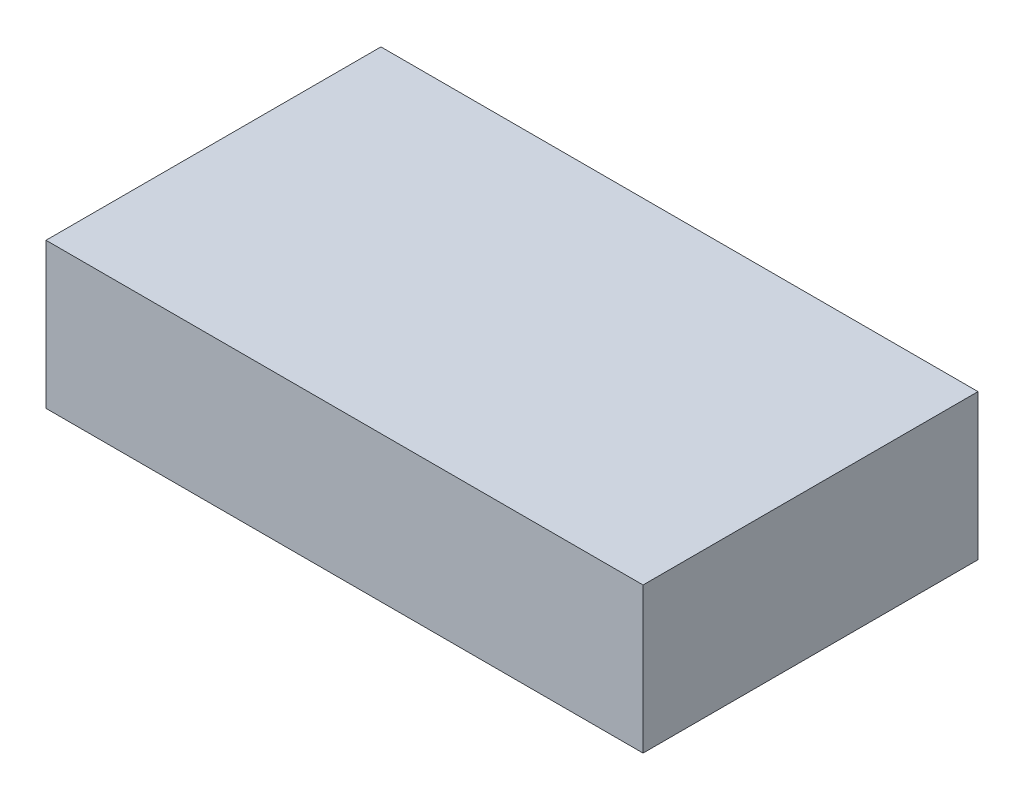
ISO-10303-21;
HEADER;
FILE_DESCRIPTION(('STEP AP214'),'2;1');
FILE_NAME('part.step','',(''),(''),'','','');
FILE_SCHEMA(('AUTOMOTIVE_DESIGN { 1 0 10303 214 1 1 1 1 }'));
ENDSEC;
DATA;
#1=APPLICATION_CONTEXT('core data for automotive mechanical design processes');
#2=APPLICATION_PROTOCOL_DEFINITION('international standard','automotive_design',2000,#1);
#3=PRODUCT_CONTEXT('',#1,'mechanical');
#4=PRODUCT('Part','Part','',(#3));
#5=PRODUCT_RELATED_PRODUCT_CATEGORY('part','',(#4));
#6=PRODUCT_DEFINITION_FORMATION('','',#4);
#7=PRODUCT_DEFINITION_CONTEXT('part definition',#1,'design');
#8=PRODUCT_DEFINITION('design','',#6,#7);
#9=PRODUCT_DEFINITION_SHAPE('','',#8);
#10=(LENGTH_UNIT() NAMED_UNIT(*) SI_UNIT(.MILLI.,.METRE.));
#11=(NAMED_UNIT(*) PLANE_ANGLE_UNIT() SI_UNIT($,.RADIAN.));
#12=(NAMED_UNIT(*) SI_UNIT($,.STERADIAN.) SOLID_ANGLE_UNIT());
#13=UNCERTAINTY_MEASURE_WITH_UNIT(LENGTH_MEASURE(1.E-05),#10,'distance_accuracy_value','');
#14=(GEOMETRIC_REPRESENTATION_CONTEXT(3) GLOBAL_UNCERTAINTY_ASSIGNED_CONTEXT((#13)) GLOBAL_UNIT_ASSIGNED_CONTEXT((#10,
#11,#12)) REPRESENTATION_CONTEXT('',''));
#15=CARTESIAN_POINT('',(0.,0.,0.));
#16=DIRECTION('',(0.,0.,1.));
#17=DIRECTION('',(1.,0.,0.));
#18=AXIS2_PLACEMENT_3D('',#15,#16,#17);
#19=CARTESIAN_POINT('',(-102.5,50.,-57.5));
#20=DIRECTION('',(0.,0.,-1.));
#21=DIRECTION('',(-1.,0.,0.));
#22=AXIS2_PLACEMENT_3D('',#19,#20,#21);
#23=PLANE('',#22);
#24=DIRECTION('',(1.,0.,0.));
#25=VECTOR('',#24,1.);
#26=CARTESIAN_POINT('',(-102.5,0.,-57.5));
#27=LINE('',#26,#25);
#28=CARTESIAN_POINT('',(-102.5,0.,-57.5));
#29=VERTEX_POINT('',#28);
#30=CARTESIAN_POINT('',(102.5,0.,-57.5));
#31=VERTEX_POINT('',#30);
#32=EDGE_CURVE('E138',#29,#31,#27,.T.);
#33=ORIENTED_EDGE('',*,*,#32,.F.);
#34=DIRECTION('',(0.,-1.,0.));
#35=VECTOR('',#34,1.);
#36=CARTESIAN_POINT('',(-102.5,50.,-57.5));
#37=LINE('',#36,#35);
#38=CARTESIAN_POINT('',(-102.5,50.,-57.5));
#39=VERTEX_POINT('',#38);
#40=EDGE_CURVE('E11',#39,#29,#37,.T.);
#41=ORIENTED_EDGE('',*,*,#40,.F.);
#42=DIRECTION('',(1.,0.,0.));
#43=VECTOR('',#42,1.);
#44=CARTESIAN_POINT('',(-102.5,50.,-57.5));
#45=LINE('',#44,#43);
#46=CARTESIAN_POINT('',(102.5,50.,-57.5));
#47=VERTEX_POINT('',#46);
#48=EDGE_CURVE('E139',#39,#47,#45,.T.);
#49=ORIENTED_EDGE('',*,*,#48,.T.);
#50=DIRECTION('',(0.,-1.,0.));
#51=VECTOR('',#50,1.);
#52=CARTESIAN_POINT('',(102.5,50.,-57.5));
#53=LINE('',#52,#51);
#54=EDGE_CURVE('E42',#47,#31,#53,.T.);
#55=ORIENTED_EDGE('',*,*,#54,.T.);
#56=EDGE_LOOP('',(#33,#41,#49,#55));
#57=FACE_BOUND('',#56,.T.);
#58=ADVANCED_FACE('F39',(#57),#23,.T.);
#59=CARTESIAN_POINT('',(-102.5,50.,57.5));
#60=DIRECTION('',(-1.,0.,0.));
#61=DIRECTION('',(0.,0.,1.));
#62=AXIS2_PLACEMENT_3D('',#59,#60,#61);
#63=PLANE('',#62);
#64=DIRECTION('',(0.,0.,-1.));
#65=VECTOR('',#64,1.);
#66=CARTESIAN_POINT('',(-102.5,0.,57.5));
#67=LINE('',#66,#65);
#68=CARTESIAN_POINT('',(-102.5,0.,57.5));
#69=VERTEX_POINT('',#68);
#70=EDGE_CURVE('E142',#69,#29,#67,.T.);
#71=ORIENTED_EDGE('',*,*,#70,.F.);
#72=DIRECTION('',(0.,-1.,0.));
#73=VECTOR('',#72,1.);
#74=CARTESIAN_POINT('',(-102.5,50.,57.5));
#75=LINE('',#74,#73);
#76=CARTESIAN_POINT('',(-102.5,50.,57.5));
#77=VERTEX_POINT('',#76);
#78=EDGE_CURVE('E49',#77,#69,#75,.T.);
#79=ORIENTED_EDGE('',*,*,#78,.F.);
#80=DIRECTION('',(0.,0.,-1.));
#81=VECTOR('',#80,1.);
#82=CARTESIAN_POINT('',(-102.5,50.,57.5));
#83=LINE('',#82,#81);
#84=EDGE_CURVE('E148',#77,#39,#83,.T.);
#85=ORIENTED_EDGE('',*,*,#84,.T.);
#86=ORIENTED_EDGE('',*,*,#40,.T.);
#87=EDGE_LOOP('',(#71,#79,#85,#86));
#88=FACE_BOUND('',#87,.T.);
#89=ADVANCED_FACE('F175',(#88),#63,.T.);
#90=CARTESIAN_POINT('',(-102.5,50.,57.5));
#91=DIRECTION('',(0.,0.,-1.));
#92=DIRECTION('',(-1.,0.,0.));
#93=AXIS2_PLACEMENT_3D('',#90,#91,#92);
#94=PLANE('',#93);
#95=DIRECTION('',(1.,0.,0.));
#96=VECTOR('',#95,1.);
#97=CARTESIAN_POINT('',(-102.5,0.,57.5));
#98=LINE('',#97,#96);
#99=CARTESIAN_POINT('',(102.5,0.,57.5));
#100=VERTEX_POINT('',#99);
#101=EDGE_CURVE('E158',#69,#100,#98,.T.);
#102=ORIENTED_EDGE('',*,*,#101,.T.);
#103=DIRECTION('',(0.,-1.,0.));
#104=VECTOR('',#103,1.);
#105=CARTESIAN_POINT('',(102.5,50.,57.5));
#106=LINE('',#105,#104);
#107=CARTESIAN_POINT('',(102.5,50.,57.5));
#108=VERTEX_POINT('',#107);
#109=EDGE_CURVE('E165',#108,#100,#106,.T.);
#110=ORIENTED_EDGE('',*,*,#109,.F.);
#111=DIRECTION('',(1.,0.,0.));
#112=VECTOR('',#111,1.);
#113=CARTESIAN_POINT('',(-102.5,50.,57.5));
#114=LINE('',#113,#112);
#115=EDGE_CURVE('E145',#77,#108,#114,.T.);
#116=ORIENTED_EDGE('',*,*,#115,.F.);
#117=ORIENTED_EDGE('',*,*,#78,.T.);
#118=EDGE_LOOP('',(#102,#110,#116,#117));
#119=FACE_BOUND('',#118,.T.);
#120=ADVANCED_FACE('F177',(#119),#94,.F.);
#121=CARTESIAN_POINT('',(102.5,50.,57.5));
#122=DIRECTION('',(-1.,0.,0.));
#123=DIRECTION('',(0.,0.,1.));
#124=AXIS2_PLACEMENT_3D('',#121,#122,#123);
#125=PLANE('',#124);
#126=DIRECTION('',(0.,0.,-1.));
#127=VECTOR('',#126,1.);
#128=CARTESIAN_POINT('',(102.5,0.,57.5));
#129=LINE('',#128,#127);
#130=EDGE_CURVE('E154',#100,#31,#129,.T.);
#131=ORIENTED_EDGE('',*,*,#130,.T.);
#132=ORIENTED_EDGE('',*,*,#54,.F.);
#133=DIRECTION('',(0.,0.,-1.));
#134=VECTOR('',#133,1.);
#135=CARTESIAN_POINT('',(102.5,50.,57.5));
#136=LINE('',#135,#134);
#137=EDGE_CURVE('E83',#108,#47,#136,.T.);
#138=ORIENTED_EDGE('',*,*,#137,.F.);
#139=ORIENTED_EDGE('',*,*,#109,.T.);
#140=EDGE_LOOP('',(#131,#132,#138,#139));
#141=FACE_BOUND('',#140,.T.);
#142=ADVANCED_FACE('F172',(#141),#125,.F.);
#143=CARTESIAN_POINT('',(0.,50.,0.));
#144=DIRECTION('',(0.,1.,0.));
#145=DIRECTION('',(0.,0.,1.));
#146=AXIS2_PLACEMENT_3D('',#143,#144,#145);
#147=PLANE('',#146);
#148=ORIENTED_EDGE('',*,*,#48,.F.);
#149=ORIENTED_EDGE('',*,*,#84,.F.);
#150=ORIENTED_EDGE('',*,*,#115,.T.);
#151=ORIENTED_EDGE('',*,*,#137,.T.);
#152=EDGE_LOOP('',(#148,#149,#150,#151));
#153=FACE_BOUND('',#152,.T.);
#154=ADVANCED_FACE('F178',(#153),#147,.T.);
#155=CARTESIAN_POINT('',(0.,0.,0.));
#156=DIRECTION('',(0.,1.,0.));
#157=DIRECTION('',(0.,0.,1.));
#158=AXIS2_PLACEMENT_3D('',#155,#156,#157);
#159=PLANE('',#158);
#160=CARTESIAN_POINT('',(-70.,0.,25.));
#161=DIRECTION('',(0.,-1.,0.));
#162=DIRECTION('',(0.,0.,-1.));
#163=AXIS2_PLACEMENT_3D('',#160,#161,#162);
#164=CIRCLE('',#163,2.25);
#165=CARTESIAN_POINT('',(-70.,0.,22.75));
#166=VERTEX_POINT('',#165);
#167=EDGE_CURVE('E109',#166,#166,#164,.T.);
#168=ORIENTED_EDGE('',*,*,#167,.F.);
#169=EDGE_LOOP('',(#168));
#170=FACE_BOUND('',#169,.T.);
#171=CARTESIAN_POINT('',(70.,0.,25.));
#172=DIRECTION('',(0.,-1.,0.));
#173=DIRECTION('',(0.,0.,-1.));
#174=AXIS2_PLACEMENT_3D('',#171,#172,#173);
#175=CIRCLE('',#174,2.25);
#176=CARTESIAN_POINT('',(70.,0.,22.75));
#177=VERTEX_POINT('',#176);
#178=EDGE_CURVE('E108',#177,#177,#175,.T.);
#179=ORIENTED_EDGE('',*,*,#178,.F.);
#180=EDGE_LOOP('',(#179));
#181=FACE_BOUND('',#180,.T.);
#182=CARTESIAN_POINT('',(70.,0.,-25.));
#183=DIRECTION('',(0.,-1.,0.));
#184=DIRECTION('',(0.,0.,-1.));
#185=AXIS2_PLACEMENT_3D('',#182,#183,#184);
#186=CIRCLE('',#185,2.25);
#187=CARTESIAN_POINT('',(70.,0.,-27.25));
#188=VERTEX_POINT('',#187);
#189=EDGE_CURVE('E122',#188,#188,#186,.T.);
#190=ORIENTED_EDGE('',*,*,#189,.F.);
#191=EDGE_LOOP('',(#190));
#192=FACE_BOUND('',#191,.T.);
#193=CARTESIAN_POINT('',(-70.,0.,-25.));
#194=DIRECTION('',(0.,-1.,0.));
#195=DIRECTION('',(0.,0.,-1.));
#196=AXIS2_PLACEMENT_3D('',#193,#194,#195);
#197=CIRCLE('',#196,2.25);
#198=CARTESIAN_POINT('',(-70.,0.,-27.25));
#199=VERTEX_POINT('',#198);
#200=EDGE_CURVE('E130',#199,#199,#197,.T.);
#201=ORIENTED_EDGE('',*,*,#200,.F.);
#202=EDGE_LOOP('',(#201));
#203=FACE_BOUND('',#202,.T.);
#204=ORIENTED_EDGE('',*,*,#32,.T.);
#205=ORIENTED_EDGE('',*,*,#130,.F.);
#206=ORIENTED_EDGE('',*,*,#101,.F.);
#207=ORIENTED_EDGE('',*,*,#70,.T.);
#208=EDGE_LOOP('',(#204,#205,#206,#207));
#209=FACE_BOUND('',#208,.T.);
#210=ADVANCED_FACE('F174',(#170,#181,#192,#203,#209),#159,.F.);
#211=CARTESIAN_POINT('',(-70.,5.,-25.));
#212=DIRECTION('',(0.,-1.,0.));
#213=DIRECTION('',(0.,0.,-1.));
#214=AXIS2_PLACEMENT_3D('',#211,#212,#213);
#215=CONICAL_SURFACE('',#214,2.25,1.02974425867665);
#216=CARTESIAN_POINT('',(-70.,6.35193639281201,-25.));
#217=VERTEX_POINT('',#216);
#218=VERTEX_LOOP('',#217);
#219=FACE_BOUND('',#218,.T.);
#220=CARTESIAN_POINT('',(-70.,5.,-25.));
#221=DIRECTION('',(0.,-1.,0.));
#222=DIRECTION('',(0.,0.,-1.));
#223=AXIS2_PLACEMENT_3D('',#220,#221,#222);
#224=CIRCLE('',#223,2.25);
#225=CARTESIAN_POINT('',(-70.,5.,-27.25));
#226=VERTEX_POINT('',#225);
#227=EDGE_CURVE('E134',#226,#226,#224,.T.);
#228=ORIENTED_EDGE('',*,*,#227,.T.);
#229=EDGE_LOOP('',(#228));
#230=FACE_BOUND('',#229,.T.);
#231=ADVANCED_FACE('F185',(#219,#230),#215,.F.);
#232=CARTESIAN_POINT('',(-70.,0.,-25.));
#233=DIRECTION('',(0.,-1.,0.));
#234=DIRECTION('',(0.,0.,-1.));
#235=AXIS2_PLACEMENT_3D('',#232,#233,#234);
#236=CYLINDRICAL_SURFACE('',#235,2.25);
#237=ORIENTED_EDGE('',*,*,#227,.F.);
#238=EDGE_LOOP('',(#237));
#239=FACE_BOUND('',#238,.T.);
#240=ORIENTED_EDGE('',*,*,#200,.T.);
#241=EDGE_LOOP('',(#240));
#242=FACE_BOUND('',#241,.T.);
#243=ADVANCED_FACE('F223',(#239,#242),#236,.F.);
#244=CARTESIAN_POINT('',(70.,5.,-25.));
#245=DIRECTION('',(0.,-1.,0.));
#246=DIRECTION('',(0.,0.,-1.));
#247=AXIS2_PLACEMENT_3D('',#244,#245,#246);
#248=CONICAL_SURFACE('',#247,2.25,1.02974425867665);
#249=CARTESIAN_POINT('',(70.,6.35193639281201,-25.));
#250=VERTEX_POINT('',#249);
#251=VERTEX_LOOP('',#250);
#252=FACE_BOUND('',#251,.T.);
#253=CARTESIAN_POINT('',(70.,5.,-25.));
#254=DIRECTION('',(0.,-1.,0.));
#255=DIRECTION('',(0.,0.,-1.));
#256=AXIS2_PLACEMENT_3D('',#253,#254,#255);
#257=CIRCLE('',#256,2.25);
#258=CARTESIAN_POINT('',(70.,5.,-27.25));
#259=VERTEX_POINT('',#258);
#260=EDGE_CURVE('E126',#259,#259,#257,.T.);
#261=ORIENTED_EDGE('',*,*,#260,.T.);
#262=EDGE_LOOP('',(#261));
#263=FACE_BOUND('',#262,.T.);
#264=ADVANCED_FACE('F232',(#252,#263),#248,.F.);
#265=CARTESIAN_POINT('',(70.,0.,-25.));
#266=DIRECTION('',(0.,-1.,0.));
#267=DIRECTION('',(0.,0.,-1.));
#268=AXIS2_PLACEMENT_3D('',#265,#266,#267);
#269=CYLINDRICAL_SURFACE('',#268,2.25);
#270=ORIENTED_EDGE('',*,*,#260,.F.);
#271=EDGE_LOOP('',(#270));
#272=FACE_BOUND('',#271,.T.);
#273=ORIENTED_EDGE('',*,*,#189,.T.);
#274=EDGE_LOOP('',(#273));
#275=FACE_BOUND('',#274,.T.);
#276=ADVANCED_FACE('F242',(#272,#275),#269,.F.);
#277=CARTESIAN_POINT('',(70.,5.,25.));
#278=DIRECTION('',(0.,-1.,0.));
#279=DIRECTION('',(0.,0.,-1.));
#280=AXIS2_PLACEMENT_3D('',#277,#278,#279);
#281=CONICAL_SURFACE('',#280,2.25,1.02974425867665);
#282=CARTESIAN_POINT('',(70.,6.35193639281201,25.));
#283=VERTEX_POINT('',#282);
#284=VERTEX_LOOP('',#283);
#285=FACE_BOUND('',#284,.T.);
#286=CARTESIAN_POINT('',(70.,5.,25.));
#287=DIRECTION('',(0.,-1.,0.));
#288=DIRECTION('',(0.,0.,-1.));
#289=AXIS2_PLACEMENT_3D('',#286,#287,#288);
#290=CIRCLE('',#289,2.25);
#291=CARTESIAN_POINT('',(70.,5.,22.75));
#292=VERTEX_POINT('',#291);
#293=EDGE_CURVE('E114',#292,#292,#290,.T.);
#294=ORIENTED_EDGE('',*,*,#293,.T.);
#295=EDGE_LOOP('',(#294));
#296=FACE_BOUND('',#295,.T.);
#297=ADVANCED_FACE('F252',(#285,#296),#281,.F.);
#298=CARTESIAN_POINT('',(70.,0.,25.));
#299=DIRECTION('',(0.,-1.,0.));
#300=DIRECTION('',(0.,0.,-1.));
#301=AXIS2_PLACEMENT_3D('',#298,#299,#300);
#302=CYLINDRICAL_SURFACE('',#301,2.25);
#303=ORIENTED_EDGE('',*,*,#293,.F.);
#304=EDGE_LOOP('',(#303));
#305=FACE_BOUND('',#304,.T.);
#306=ORIENTED_EDGE('',*,*,#178,.T.);
#307=EDGE_LOOP('',(#306));
#308=FACE_BOUND('',#307,.T.);
#309=ADVANCED_FACE('F101',(#305,#308),#302,.F.);
#310=CARTESIAN_POINT('',(-70.,5.,25.));
#311=DIRECTION('',(0.,-1.,0.));
#312=DIRECTION('',(0.,0.,-1.));
#313=AXIS2_PLACEMENT_3D('',#310,#311,#312);
#314=CONICAL_SURFACE('',#313,2.25,1.02974425867665);
#315=CARTESIAN_POINT('',(-70.,6.35193639281201,25.));
#316=VERTEX_POINT('',#315);
#317=VERTEX_LOOP('',#316);
#318=FACE_BOUND('',#317,.T.);
#319=CARTESIAN_POINT('',(-70.,5.,25.));
#320=DIRECTION('',(0.,-1.,0.));
#321=DIRECTION('',(0.,0.,-1.));
#322=AXIS2_PLACEMENT_3D('',#319,#320,#321);
#323=CIRCLE('',#322,2.25);
#324=CARTESIAN_POINT('',(-70.,5.,22.75));
#325=VERTEX_POINT('',#324);
#326=EDGE_CURVE('E105',#325,#325,#323,.T.);
#327=ORIENTED_EDGE('',*,*,#326,.T.);
#328=EDGE_LOOP('',(#327));
#329=FACE_BOUND('',#328,.T.);
#330=ADVANCED_FACE('F97',(#318,#329),#314,.F.);
#331=CARTESIAN_POINT('',(-70.,0.,25.));
#332=DIRECTION('',(0.,-1.,0.));
#333=DIRECTION('',(0.,0.,-1.));
#334=AXIS2_PLACEMENT_3D('',#331,#332,#333);
#335=CYLINDRICAL_SURFACE('',#334,2.25);
#336=ORIENTED_EDGE('',*,*,#326,.F.);
#337=EDGE_LOOP('',(#336));
#338=FACE_BOUND('',#337,.T.);
#339=ORIENTED_EDGE('',*,*,#167,.T.);
#340=EDGE_LOOP('',(#339));
#341=FACE_BOUND('',#340,.T.);
#342=ADVANCED_FACE('F100',(#338,#341),#335,.F.);
#343=CLOSED_SHELL('',(#58,#89,#120,#142,#154,#210,#231,#243,#264,#276,#297,#309,#330,#342));
#344=MANIFOLD_SOLID_BREP('B2',#343);
#345=ADVANCED_BREP_SHAPE_REPRESENTATION('',(#18,#344),#14);
#346=SHAPE_DEFINITION_REPRESENTATION(#9,#345);
ENDSEC;
END-ISO-10303-21;
